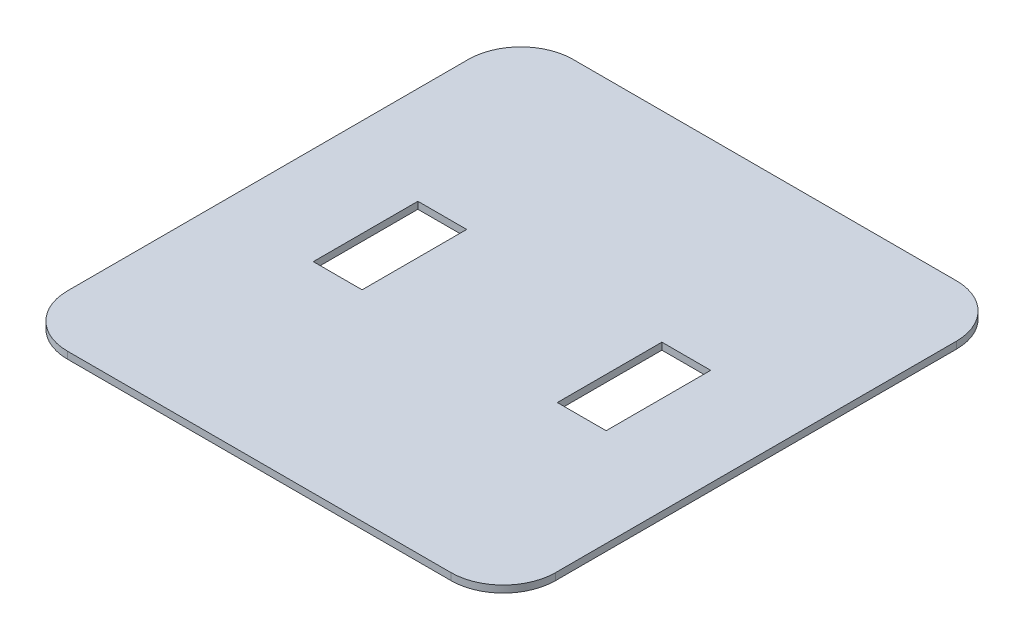
ISO-10303-21;
HEADER;
FILE_DESCRIPTION(('STEP AP214'),'2;1');
FILE_NAME('part.step','',(''),(''),'','','');
FILE_SCHEMA(('AUTOMOTIVE_DESIGN { 1 0 10303 214 1 1 1 1 }'));
ENDSEC;
DATA;
#1=APPLICATION_CONTEXT('core data for automotive mechanical design processes');
#2=APPLICATION_PROTOCOL_DEFINITION('international standard','automotive_design',2000,#1);
#3=PRODUCT_CONTEXT('',#1,'mechanical');
#4=PRODUCT('Part','Part','',(#3));
#5=PRODUCT_RELATED_PRODUCT_CATEGORY('part','',(#4));
#6=PRODUCT_DEFINITION_FORMATION('','',#4);
#7=PRODUCT_DEFINITION_CONTEXT('part definition',#1,'design');
#8=PRODUCT_DEFINITION('design','',#6,#7);
#9=PRODUCT_DEFINITION_SHAPE('','',#8);
#10=(LENGTH_UNIT() NAMED_UNIT(*) SI_UNIT(.MILLI.,.METRE.));
#11=(NAMED_UNIT(*) PLANE_ANGLE_UNIT() SI_UNIT($,.RADIAN.));
#12=(NAMED_UNIT(*) SI_UNIT($,.STERADIAN.) SOLID_ANGLE_UNIT());
#13=UNCERTAINTY_MEASURE_WITH_UNIT(LENGTH_MEASURE(1.E-05),#10,'distance_accuracy_value','');
#14=(GEOMETRIC_REPRESENTATION_CONTEXT(3) GLOBAL_UNCERTAINTY_ASSIGNED_CONTEXT((#13)) GLOBAL_UNIT_ASSIGNED_CONTEXT((#10,
#11,#12)) REPRESENTATION_CONTEXT('',''));
#15=CARTESIAN_POINT('',(0.,0.,0.));
#16=DIRECTION('',(0.,0.,1.));
#17=DIRECTION('',(1.,0.,0.));
#18=AXIS2_PLACEMENT_3D('',#15,#16,#17);
#19=CARTESIAN_POINT('',(-110.,4.,30.));
#20=DIRECTION('',(0.,1.,0.));
#21=DIRECTION('',(0.,0.,1.));
#22=AXIS2_PLACEMENT_3D('',#19,#20,#21);
#23=PLANE('',#22);
#24=DIRECTION('',(1.,0.,0.));
#25=VECTOR('',#24,1.);
#26=CARTESIAN_POINT('',(-84.,4.,175.));
#27=LINE('',#26,#25);
#28=CARTESIAN_POINT('',(-84.,4.,175.));
#29=VERTEX_POINT('',#28);
#30=CARTESIAN_POINT('',(-56.,4.,175.));
#31=VERTEX_POINT('',#30);
#32=EDGE_CURVE('E181',#29,#31,#27,.T.);
#33=ORIENTED_EDGE('',*,*,#32,.F.);
#34=DIRECTION('',(0.,0.,1.));
#35=VECTOR('',#34,1.);
#36=CARTESIAN_POINT('',(-84.,4.,175.));
#37=LINE('',#36,#35);
#38=CARTESIAN_POINT('',(-84.,4.,115.));
#39=VERTEX_POINT('',#38);
#40=EDGE_CURVE('E179',#39,#29,#37,.T.);
#41=ORIENTED_EDGE('',*,*,#40,.F.);
#42=DIRECTION('',(-1.,0.,0.));
#43=VECTOR('',#42,1.);
#44=CARTESIAN_POINT('',(-84.,4.,115.));
#45=LINE('',#44,#43);
#46=CARTESIAN_POINT('',(-56.,4.,115.));
#47=VERTEX_POINT('',#46);
#48=EDGE_CURVE('E187',#47,#39,#45,.T.);
#49=ORIENTED_EDGE('',*,*,#48,.F.);
#50=DIRECTION('',(0.,0.,-1.));
#51=VECTOR('',#50,1.);
#52=CARTESIAN_POINT('',(-56.,4.,175.));
#53=LINE('',#52,#51);
#54=EDGE_CURVE('E184',#31,#47,#53,.T.);
#55=ORIENTED_EDGE('',*,*,#54,.F.);
#56=EDGE_LOOP('',(#33,#41,#49,#55));
#57=FACE_BOUND('',#56,.T.);
#58=CARTESIAN_POINT('',(-110.,4.,30.));
#59=DIRECTION('',(0.,1.,0.));
#60=DIRECTION('',(0.,0.,1.));
#61=AXIS2_PLACEMENT_3D('',#58,#59,#60);
#62=CIRCLE('',#61,30.);
#63=CARTESIAN_POINT('',(-110.,4.,0.));
#64=VERTEX_POINT('',#63);
#65=CARTESIAN_POINT('',(-140.,4.,30.));
#66=VERTEX_POINT('',#65);
#67=EDGE_CURVE('E210',#64,#66,#62,.T.);
#68=ORIENTED_EDGE('',*,*,#67,.T.);
#69=DIRECTION('',(0.,0.,1.));
#70=VECTOR('',#69,1.);
#71=CARTESIAN_POINT('',(-140.,4.,30.));
#72=LINE('',#71,#70);
#73=CARTESIAN_POINT('',(-140.,4.,260.));
#74=VERTEX_POINT('',#73);
#75=EDGE_CURVE('E213',#66,#74,#72,.T.);
#76=ORIENTED_EDGE('',*,*,#75,.T.);
#77=CARTESIAN_POINT('',(-110.,4.,260.));
#78=DIRECTION('',(0.,1.,0.));
#79=DIRECTION('',(0.,0.,1.));
#80=AXIS2_PLACEMENT_3D('',#77,#78,#79);
#81=CIRCLE('',#80,30.);
#82=CARTESIAN_POINT('',(-110.,4.,290.));
#83=VERTEX_POINT('',#82);
#84=EDGE_CURVE('E216',#74,#83,#81,.T.);
#85=ORIENTED_EDGE('',*,*,#84,.T.);
#86=DIRECTION('',(1.,0.,0.));
#87=VECTOR('',#86,1.);
#88=CARTESIAN_POINT('',(-110.,4.,290.));
#89=LINE('',#88,#87);
#90=CARTESIAN_POINT('',(110.,4.,290.));
#91=VERTEX_POINT('',#90);
#92=EDGE_CURVE('E218',#83,#91,#89,.T.);
#93=ORIENTED_EDGE('',*,*,#92,.T.);
#94=CARTESIAN_POINT('',(110.,4.,260.));
#95=DIRECTION('',(0.,1.,0.));
#96=DIRECTION('',(0.,0.,-1.));
#97=AXIS2_PLACEMENT_3D('',#94,#95,#96);
#98=CIRCLE('',#97,30.);
#99=CARTESIAN_POINT('',(140.,4.,260.));
#100=VERTEX_POINT('',#99);
#101=EDGE_CURVE('E220',#91,#100,#98,.T.);
#102=ORIENTED_EDGE('',*,*,#101,.T.);
#103=DIRECTION('',(0.,0.,-1.));
#104=VECTOR('',#103,1.);
#105=CARTESIAN_POINT('',(140.,4.,30.));
#106=LINE('',#105,#104);
#107=CARTESIAN_POINT('',(140.,4.,30.));
#108=VERTEX_POINT('',#107);
#109=EDGE_CURVE('E222',#100,#108,#106,.T.);
#110=ORIENTED_EDGE('',*,*,#109,.T.);
#111=CARTESIAN_POINT('',(110.,4.,30.));
#112=DIRECTION('',(0.,1.,0.));
#113=DIRECTION('',(0.,0.,-1.));
#114=AXIS2_PLACEMENT_3D('',#111,#112,#113);
#115=CIRCLE('',#114,30.);
#116=CARTESIAN_POINT('',(110.,4.,0.));
#117=VERTEX_POINT('',#116);
#118=EDGE_CURVE('E224',#108,#117,#115,.T.);
#119=ORIENTED_EDGE('',*,*,#118,.T.);
#120=DIRECTION('',(-1.,0.,0.));
#121=VECTOR('',#120,1.);
#122=CARTESIAN_POINT('',(110.,4.,0.));
#123=LINE('',#122,#121);
#124=EDGE_CURVE('E226',#117,#64,#123,.T.);
#125=ORIENTED_EDGE('',*,*,#124,.T.);
#126=EDGE_LOOP('',(#68,#76,#85,#93,#102,#110,#119,#125));
#127=FACE_BOUND('',#126,.T.);
#128=DIRECTION('',(-1.,0.,0.));
#129=VECTOR('',#128,1.);
#130=CARTESIAN_POINT('',(84.,4.,115.));
#131=LINE('',#130,#129);
#132=CARTESIAN_POINT('',(84.,4.,115.));
#133=VERTEX_POINT('',#132);
#134=CARTESIAN_POINT('',(56.,4.,115.));
#135=VERTEX_POINT('',#134);
#136=EDGE_CURVE('E151',#133,#135,#131,.T.);
#137=ORIENTED_EDGE('',*,*,#136,.F.);
#138=DIRECTION('',(0.,0.,-1.));
#139=VECTOR('',#138,1.);
#140=CARTESIAN_POINT('',(84.,4.,175.));
#141=LINE('',#140,#139);
#142=CARTESIAN_POINT('',(84.,4.,175.));
#143=VERTEX_POINT('',#142);
#144=EDGE_CURVE('E143',#143,#133,#141,.T.);
#145=ORIENTED_EDGE('',*,*,#144,.F.);
#146=DIRECTION('',(1.,0.,0.));
#147=VECTOR('',#146,1.);
#148=CARTESIAN_POINT('',(84.,4.,175.));
#149=LINE('',#148,#147);
#150=CARTESIAN_POINT('',(56.,4.,175.));
#151=VERTEX_POINT('',#150);
#152=EDGE_CURVE('E165',#151,#143,#149,.T.);
#153=ORIENTED_EDGE('',*,*,#152,.F.);
#154=DIRECTION('',(0.,0.,1.));
#155=VECTOR('',#154,1.);
#156=CARTESIAN_POINT('',(56.,4.,175.));
#157=LINE('',#156,#155);
#158=EDGE_CURVE('E163',#135,#151,#157,.T.);
#159=ORIENTED_EDGE('',*,*,#158,.F.);
#160=EDGE_LOOP('',(#137,#145,#153,#159));
#161=FACE_BOUND('',#160,.T.);
#162=ADVANCED_FACE('F30',(#57,#127,#161),#23,.T.);
#163=CARTESIAN_POINT('',(-110.,0.,30.));
#164=DIRECTION('',(0.,1.,0.));
#165=DIRECTION('',(0.,0.,1.));
#166=AXIS2_PLACEMENT_3D('',#163,#164,#165);
#167=PLANE('',#166);
#168=DIRECTION('',(0.,0.,1.));
#169=VECTOR('',#168,1.);
#170=CARTESIAN_POINT('',(-84.,0.,175.));
#171=LINE('',#170,#169);
#172=CARTESIAN_POINT('',(-84.,0.,115.));
#173=VERTEX_POINT('',#172);
#174=CARTESIAN_POINT('',(-84.,0.,175.));
#175=VERTEX_POINT('',#174);
#176=EDGE_CURVE('E159',#173,#175,#171,.T.);
#177=ORIENTED_EDGE('',*,*,#176,.T.);
#178=DIRECTION('',(1.,0.,0.));
#179=VECTOR('',#178,1.);
#180=CARTESIAN_POINT('',(-84.,0.,175.));
#181=LINE('',#180,#179);
#182=CARTESIAN_POINT('',(-56.,0.,175.));
#183=VERTEX_POINT('',#182);
#184=EDGE_CURVE('E192',#175,#183,#181,.T.);
#185=ORIENTED_EDGE('',*,*,#184,.T.);
#186=DIRECTION('',(0.,0.,-1.));
#187=VECTOR('',#186,1.);
#188=CARTESIAN_POINT('',(-56.,0.,175.));
#189=LINE('',#188,#187);
#190=CARTESIAN_POINT('',(-56.,0.,115.));
#191=VERTEX_POINT('',#190);
#192=EDGE_CURVE('E195',#183,#191,#189,.T.);
#193=ORIENTED_EDGE('',*,*,#192,.T.);
#194=DIRECTION('',(-1.,0.,0.));
#195=VECTOR('',#194,1.);
#196=CARTESIAN_POINT('',(-84.,0.,115.));
#197=LINE('',#196,#195);
#198=EDGE_CURVE('E182',#191,#173,#197,.T.);
#199=ORIENTED_EDGE('',*,*,#198,.T.);
#200=EDGE_LOOP('',(#177,#185,#193,#199));
#201=FACE_BOUND('',#200,.T.);
#202=CARTESIAN_POINT('',(-110.,0.,30.));
#203=DIRECTION('',(0.,1.,0.));
#204=DIRECTION('',(0.,0.,1.));
#205=AXIS2_PLACEMENT_3D('',#202,#203,#204);
#206=CIRCLE('',#205,30.);
#207=CARTESIAN_POINT('',(-110.,0.,0.));
#208=VERTEX_POINT('',#207);
#209=CARTESIAN_POINT('',(-140.,0.,30.));
#210=VERTEX_POINT('',#209);
#211=EDGE_CURVE('E209',#208,#210,#206,.T.);
#212=ORIENTED_EDGE('',*,*,#211,.F.);
#213=DIRECTION('',(-1.,0.,0.));
#214=VECTOR('',#213,1.);
#215=CARTESIAN_POINT('',(110.,0.,0.));
#216=LINE('',#215,#214);
#217=CARTESIAN_POINT('',(110.,0.,0.));
#218=VERTEX_POINT('',#217);
#219=EDGE_CURVE('E214',#218,#208,#216,.T.);
#220=ORIENTED_EDGE('',*,*,#219,.F.);
#221=CARTESIAN_POINT('',(110.,0.,30.));
#222=DIRECTION('',(0.,1.,0.));
#223=DIRECTION('',(0.,0.,-1.));
#224=AXIS2_PLACEMENT_3D('',#221,#222,#223);
#225=CIRCLE('',#224,30.);
#226=CARTESIAN_POINT('',(140.,0.,30.));
#227=VERTEX_POINT('',#226);
#228=EDGE_CURVE('E241',#227,#218,#225,.T.);
#229=ORIENTED_EDGE('',*,*,#228,.F.);
#230=DIRECTION('',(0.,0.,-1.));
#231=VECTOR('',#230,1.);
#232=CARTESIAN_POINT('',(140.,0.,30.));
#233=LINE('',#232,#231);
#234=CARTESIAN_POINT('',(140.,0.,260.));
#235=VERTEX_POINT('',#234);
#236=EDGE_CURVE('E239',#235,#227,#233,.T.);
#237=ORIENTED_EDGE('',*,*,#236,.F.);
#238=CARTESIAN_POINT('',(110.,0.,260.));
#239=DIRECTION('',(0.,1.,0.));
#240=DIRECTION('',(0.,0.,-1.));
#241=AXIS2_PLACEMENT_3D('',#238,#239,#240);
#242=CIRCLE('',#241,30.);
#243=CARTESIAN_POINT('',(110.,0.,290.));
#244=VERTEX_POINT('',#243);
#245=EDGE_CURVE('E237',#244,#235,#242,.T.);
#246=ORIENTED_EDGE('',*,*,#245,.F.);
#247=DIRECTION('',(1.,0.,0.));
#248=VECTOR('',#247,1.);
#249=CARTESIAN_POINT('',(-110.,0.,290.));
#250=LINE('',#249,#248);
#251=CARTESIAN_POINT('',(-110.,0.,290.));
#252=VERTEX_POINT('',#251);
#253=EDGE_CURVE('E235',#252,#244,#250,.T.);
#254=ORIENTED_EDGE('',*,*,#253,.F.);
#255=CARTESIAN_POINT('',(-110.,0.,260.));
#256=DIRECTION('',(0.,1.,0.));
#257=DIRECTION('',(0.,0.,1.));
#258=AXIS2_PLACEMENT_3D('',#255,#256,#257);
#259=CIRCLE('',#258,30.);
#260=CARTESIAN_POINT('',(-140.,0.,260.));
#261=VERTEX_POINT('',#260);
#262=EDGE_CURVE('E233',#261,#252,#259,.T.);
#263=ORIENTED_EDGE('',*,*,#262,.F.);
#264=DIRECTION('',(0.,0.,1.));
#265=VECTOR('',#264,1.);
#266=CARTESIAN_POINT('',(-140.,0.,30.));
#267=LINE('',#266,#265);
#268=EDGE_CURVE('E231',#210,#261,#267,.T.);
#269=ORIENTED_EDGE('',*,*,#268,.F.);
#270=EDGE_LOOP('',(#212,#220,#229,#237,#246,#254,#263,#269));
#271=FACE_BOUND('',#270,.T.);
#272=DIRECTION('',(0.,0.,-1.));
#273=VECTOR('',#272,1.);
#274=CARTESIAN_POINT('',(84.,0.,175.));
#275=LINE('',#274,#273);
#276=CARTESIAN_POINT('',(84.,0.,175.));
#277=VERTEX_POINT('',#276);
#278=CARTESIAN_POINT('',(84.,0.,115.));
#279=VERTEX_POINT('',#278);
#280=EDGE_CURVE('E53',#277,#279,#275,.T.);
#281=ORIENTED_EDGE('',*,*,#280,.T.);
#282=DIRECTION('',(-1.,0.,0.));
#283=VECTOR('',#282,1.);
#284=CARTESIAN_POINT('',(84.,0.,115.));
#285=LINE('',#284,#283);
#286=CARTESIAN_POINT('',(56.,0.,115.));
#287=VERTEX_POINT('',#286);
#288=EDGE_CURVE('E158',#279,#287,#285,.T.);
#289=ORIENTED_EDGE('',*,*,#288,.T.);
#290=DIRECTION('',(0.,0.,1.));
#291=VECTOR('',#290,1.);
#292=CARTESIAN_POINT('',(56.,0.,175.));
#293=LINE('',#292,#291);
#294=CARTESIAN_POINT('',(56.,0.,175.));
#295=VERTEX_POINT('',#294);
#296=EDGE_CURVE('E171',#287,#295,#293,.T.);
#297=ORIENTED_EDGE('',*,*,#296,.T.);
#298=DIRECTION('',(1.,0.,0.));
#299=VECTOR('',#298,1.);
#300=CARTESIAN_POINT('',(84.,0.,175.));
#301=LINE('',#300,#299);
#302=EDGE_CURVE('E152',#295,#277,#301,.T.);
#303=ORIENTED_EDGE('',*,*,#302,.T.);
#304=EDGE_LOOP('',(#281,#289,#297,#303));
#305=FACE_BOUND('',#304,.T.);
#306=ADVANCED_FACE('F271',(#201,#271,#305),#167,.F.);
#307=CARTESIAN_POINT('',(-110.,4.,30.));
#308=DIRECTION('',(0.,-1.,0.));
#309=DIRECTION('',(0.,0.,-1.));
#310=AXIS2_PLACEMENT_3D('',#307,#308,#309);
#311=CYLINDRICAL_SURFACE('',#310,30.);
#312=ORIENTED_EDGE('',*,*,#211,.T.);
#313=DIRECTION('',(0.,-1.,0.));
#314=VECTOR('',#313,1.);
#315=CARTESIAN_POINT('',(-140.,4.,30.));
#316=LINE('',#315,#314);
#317=EDGE_CURVE('E11',#66,#210,#316,.T.);
#318=ORIENTED_EDGE('',*,*,#317,.F.);
#319=ORIENTED_EDGE('',*,*,#67,.F.);
#320=DIRECTION('',(0.,-1.,0.));
#321=VECTOR('',#320,1.);
#322=CARTESIAN_POINT('',(-110.,4.,0.));
#323=LINE('',#322,#321);
#324=EDGE_CURVE('E228',#64,#208,#323,.T.);
#325=ORIENTED_EDGE('',*,*,#324,.T.);
#326=EDGE_LOOP('',(#312,#318,#319,#325));
#327=FACE_BOUND('',#326,.T.);
#328=ADVANCED_FACE('F32',(#327),#311,.T.);
#329=CARTESIAN_POINT('',(-140.,4.,30.));
#330=DIRECTION('',(1.,0.,0.));
#331=DIRECTION('',(0.,0.,-1.));
#332=AXIS2_PLACEMENT_3D('',#329,#330,#331);
#333=PLANE('',#332);
#334=ORIENTED_EDGE('',*,*,#268,.T.);
#335=DIRECTION('',(0.,-1.,0.));
#336=VECTOR('',#335,1.);
#337=CARTESIAN_POINT('',(-140.,4.,260.));
#338=LINE('',#337,#336);
#339=EDGE_CURVE('E38',#74,#261,#338,.T.);
#340=ORIENTED_EDGE('',*,*,#339,.F.);
#341=ORIENTED_EDGE('',*,*,#75,.F.);
#342=ORIENTED_EDGE('',*,*,#317,.T.);
#343=EDGE_LOOP('',(#334,#340,#341,#342));
#344=FACE_BOUND('',#343,.T.);
#345=ADVANCED_FACE('F288',(#344),#333,.F.);
#346=CARTESIAN_POINT('',(-110.,4.,260.));
#347=DIRECTION('',(0.,-1.,0.));
#348=DIRECTION('',(0.,0.,-1.));
#349=AXIS2_PLACEMENT_3D('',#346,#347,#348);
#350=CYLINDRICAL_SURFACE('',#349,30.);
#351=ORIENTED_EDGE('',*,*,#262,.T.);
#352=DIRECTION('',(0.,-1.,0.));
#353=VECTOR('',#352,1.);
#354=CARTESIAN_POINT('',(-110.,4.,290.));
#355=LINE('',#354,#353);
#356=EDGE_CURVE('E258',#83,#252,#355,.T.);
#357=ORIENTED_EDGE('',*,*,#356,.F.);
#358=ORIENTED_EDGE('',*,*,#84,.F.);
#359=ORIENTED_EDGE('',*,*,#339,.T.);
#360=EDGE_LOOP('',(#351,#357,#358,#359));
#361=FACE_BOUND('',#360,.T.);
#362=ADVANCED_FACE('F265',(#361),#350,.T.);
#363=CARTESIAN_POINT('',(-110.,4.,290.));
#364=DIRECTION('',(0.,0.,-1.));
#365=DIRECTION('',(-1.,0.,0.));
#366=AXIS2_PLACEMENT_3D('',#363,#364,#365);
#367=PLANE('',#366);
#368=ORIENTED_EDGE('',*,*,#253,.T.);
#369=DIRECTION('',(0.,-1.,0.));
#370=VECTOR('',#369,1.);
#371=CARTESIAN_POINT('',(110.,4.,290.));
#372=LINE('',#371,#370);
#373=EDGE_CURVE('E255',#91,#244,#372,.T.);
#374=ORIENTED_EDGE('',*,*,#373,.F.);
#375=ORIENTED_EDGE('',*,*,#92,.F.);
#376=ORIENTED_EDGE('',*,*,#356,.T.);
#377=EDGE_LOOP('',(#368,#374,#375,#376));
#378=FACE_BOUND('',#377,.T.);
#379=ADVANCED_FACE('F277',(#378),#367,.F.);
#380=CARTESIAN_POINT('',(110.,4.,260.));
#381=DIRECTION('',(0.,-1.,0.));
#382=DIRECTION('',(0.,0.,-1.));
#383=AXIS2_PLACEMENT_3D('',#380,#381,#382);
#384=CYLINDRICAL_SURFACE('',#383,30.);
#385=ORIENTED_EDGE('',*,*,#245,.T.);
#386=DIRECTION('',(0.,-1.,0.));
#387=VECTOR('',#386,1.);
#388=CARTESIAN_POINT('',(140.,4.,260.));
#389=LINE('',#388,#387);
#390=EDGE_CURVE('E252',#100,#235,#389,.T.);
#391=ORIENTED_EDGE('',*,*,#390,.F.);
#392=ORIENTED_EDGE('',*,*,#101,.F.);
#393=ORIENTED_EDGE('',*,*,#373,.T.);
#394=EDGE_LOOP('',(#385,#391,#392,#393));
#395=FACE_BOUND('',#394,.T.);
#396=ADVANCED_FACE('F281',(#395),#384,.T.);
#397=CARTESIAN_POINT('',(140.,4.,30.));
#398=DIRECTION('',(-1.,0.,0.));
#399=DIRECTION('',(0.,0.,1.));
#400=AXIS2_PLACEMENT_3D('',#397,#398,#399);
#401=PLANE('',#400);
#402=ORIENTED_EDGE('',*,*,#236,.T.);
#403=DIRECTION('',(0.,-1.,0.));
#404=VECTOR('',#403,1.);
#405=CARTESIAN_POINT('',(140.,4.,30.));
#406=LINE('',#405,#404);
#407=EDGE_CURVE('E249',#108,#227,#406,.T.);
#408=ORIENTED_EDGE('',*,*,#407,.F.);
#409=ORIENTED_EDGE('',*,*,#109,.F.);
#410=ORIENTED_EDGE('',*,*,#390,.T.);
#411=EDGE_LOOP('',(#402,#408,#409,#410));
#412=FACE_BOUND('',#411,.T.);
#413=ADVANCED_FACE('F301',(#412),#401,.F.);
#414=CARTESIAN_POINT('',(110.,4.,30.));
#415=DIRECTION('',(0.,-1.,0.));
#416=DIRECTION('',(0.,0.,-1.));
#417=AXIS2_PLACEMENT_3D('',#414,#415,#416);
#418=CYLINDRICAL_SURFACE('',#417,30.);
#419=ORIENTED_EDGE('',*,*,#228,.T.);
#420=DIRECTION('',(0.,-1.,0.));
#421=VECTOR('',#420,1.);
#422=CARTESIAN_POINT('',(110.,4.,0.));
#423=LINE('',#422,#421);
#424=EDGE_CURVE('E246',#117,#218,#423,.T.);
#425=ORIENTED_EDGE('',*,*,#424,.F.);
#426=ORIENTED_EDGE('',*,*,#118,.F.);
#427=ORIENTED_EDGE('',*,*,#407,.T.);
#428=EDGE_LOOP('',(#419,#425,#426,#427));
#429=FACE_BOUND('',#428,.T.);
#430=ADVANCED_FACE('F299',(#429),#418,.T.);
#431=CARTESIAN_POINT('',(110.,4.,0.));
#432=DIRECTION('',(0.,0.,1.));
#433=DIRECTION('',(1.,0.,0.));
#434=AXIS2_PLACEMENT_3D('',#431,#432,#433);
#435=PLANE('',#434);
#436=ORIENTED_EDGE('',*,*,#219,.T.);
#437=ORIENTED_EDGE('',*,*,#324,.F.);
#438=ORIENTED_EDGE('',*,*,#124,.F.);
#439=ORIENTED_EDGE('',*,*,#424,.T.);
#440=EDGE_LOOP('',(#436,#437,#438,#439));
#441=FACE_BOUND('',#440,.T.);
#442=ADVANCED_FACE('F294',(#441),#435,.F.);
#443=CARTESIAN_POINT('',(-84.,4.,175.));
#444=DIRECTION('',(1.,0.,0.));
#445=DIRECTION('',(0.,0.,-1.));
#446=AXIS2_PLACEMENT_3D('',#443,#444,#445);
#447=PLANE('',#446);
#448=ORIENTED_EDGE('',*,*,#176,.F.);
#449=DIRECTION('',(0.,-1.,0.));
#450=VECTOR('',#449,1.);
#451=CARTESIAN_POINT('',(-84.,4.,115.));
#452=LINE('',#451,#450);
#453=EDGE_CURVE('E189',#39,#173,#452,.T.);
#454=ORIENTED_EDGE('',*,*,#453,.F.);
#455=ORIENTED_EDGE('',*,*,#40,.T.);
#456=DIRECTION('',(0.,-1.,0.));
#457=VECTOR('',#456,1.);
#458=CARTESIAN_POINT('',(-84.,4.,175.));
#459=LINE('',#458,#457);
#460=EDGE_CURVE('E206',#29,#175,#459,.T.);
#461=ORIENTED_EDGE('',*,*,#460,.T.);
#462=EDGE_LOOP('',(#448,#454,#455,#461));
#463=FACE_BOUND('',#462,.T.);
#464=ADVANCED_FACE('F320',(#463),#447,.T.);
#465=CARTESIAN_POINT('',(-84.,4.,175.));
#466=DIRECTION('',(0.,0.,-1.));
#467=DIRECTION('',(-1.,0.,0.));
#468=AXIS2_PLACEMENT_3D('',#465,#466,#467);
#469=PLANE('',#468);
#470=ORIENTED_EDGE('',*,*,#184,.F.);
#471=ORIENTED_EDGE('',*,*,#460,.F.);
#472=ORIENTED_EDGE('',*,*,#32,.T.);
#473=DIRECTION('',(0.,-1.,0.));
#474=VECTOR('',#473,1.);
#475=CARTESIAN_POINT('',(-56.,4.,175.));
#476=LINE('',#475,#474);
#477=EDGE_CURVE('E204',#31,#183,#476,.T.);
#478=ORIENTED_EDGE('',*,*,#477,.T.);
#479=EDGE_LOOP('',(#470,#471,#472,#478));
#480=FACE_BOUND('',#479,.T.);
#481=ADVANCED_FACE('F327',(#480),#469,.T.);
#482=CARTESIAN_POINT('',(-56.,4.,175.));
#483=DIRECTION('',(-1.,0.,0.));
#484=DIRECTION('',(0.,0.,1.));
#485=AXIS2_PLACEMENT_3D('',#482,#483,#484);
#486=PLANE('',#485);
#487=ORIENTED_EDGE('',*,*,#192,.F.);
#488=ORIENTED_EDGE('',*,*,#477,.F.);
#489=ORIENTED_EDGE('',*,*,#54,.T.);
#490=DIRECTION('',(0.,-1.,0.));
#491=VECTOR('',#490,1.);
#492=CARTESIAN_POINT('',(-56.,4.,115.));
#493=LINE('',#492,#491);
#494=EDGE_CURVE('E202',#47,#191,#493,.T.);
#495=ORIENTED_EDGE('',*,*,#494,.T.);
#496=EDGE_LOOP('',(#487,#488,#489,#495));
#497=FACE_BOUND('',#496,.T.);
#498=ADVANCED_FACE('F332',(#497),#486,.T.);
#499=CARTESIAN_POINT('',(-84.,4.,115.));
#500=DIRECTION('',(0.,0.,1.));
#501=DIRECTION('',(1.,0.,0.));
#502=AXIS2_PLACEMENT_3D('',#499,#500,#501);
#503=PLANE('',#502);
#504=ORIENTED_EDGE('',*,*,#198,.F.);
#505=ORIENTED_EDGE('',*,*,#494,.F.);
#506=ORIENTED_EDGE('',*,*,#48,.T.);
#507=ORIENTED_EDGE('',*,*,#453,.T.);
#508=EDGE_LOOP('',(#504,#505,#506,#507));
#509=FACE_BOUND('',#508,.T.);
#510=ADVANCED_FACE('F339',(#509),#503,.T.);
#511=CARTESIAN_POINT('',(84.,4.,175.));
#512=DIRECTION('',(-1.,0.,0.));
#513=DIRECTION('',(0.,0.,1.));
#514=AXIS2_PLACEMENT_3D('',#511,#512,#513);
#515=PLANE('',#514);
#516=ORIENTED_EDGE('',*,*,#280,.F.);
#517=DIRECTION('',(0.,-1.,0.));
#518=VECTOR('',#517,1.);
#519=CARTESIAN_POINT('',(84.,4.,175.));
#520=LINE('',#519,#518);
#521=EDGE_CURVE('E147',#143,#277,#520,.T.);
#522=ORIENTED_EDGE('',*,*,#521,.F.);
#523=ORIENTED_EDGE('',*,*,#144,.T.);
#524=DIRECTION('',(0.,-1.,0.));
#525=VECTOR('',#524,1.);
#526=CARTESIAN_POINT('',(84.,4.,115.));
#527=LINE('',#526,#525);
#528=EDGE_CURVE('E146',#133,#279,#527,.T.);
#529=ORIENTED_EDGE('',*,*,#528,.T.);
#530=EDGE_LOOP('',(#516,#522,#523,#529));
#531=FACE_BOUND('',#530,.T.);
#532=ADVANCED_FACE('F145',(#531),#515,.T.);
#533=CARTESIAN_POINT('',(84.,4.,115.));
#534=DIRECTION('',(0.,0.,1.));
#535=DIRECTION('',(1.,0.,0.));
#536=AXIS2_PLACEMENT_3D('',#533,#534,#535);
#537=PLANE('',#536);
#538=ORIENTED_EDGE('',*,*,#288,.F.);
#539=ORIENTED_EDGE('',*,*,#528,.F.);
#540=ORIENTED_EDGE('',*,*,#136,.T.);
#541=DIRECTION('',(0.,-1.,0.));
#542=VECTOR('',#541,1.);
#543=CARTESIAN_POINT('',(56.,4.,115.));
#544=LINE('',#543,#542);
#545=EDGE_CURVE('E160',#135,#287,#544,.T.);
#546=ORIENTED_EDGE('',*,*,#545,.T.);
#547=EDGE_LOOP('',(#538,#539,#540,#546));
#548=FACE_BOUND('',#547,.T.);
#549=ADVANCED_FACE('F155',(#548),#537,.T.);
#550=CARTESIAN_POINT('',(56.,4.,175.));
#551=DIRECTION('',(1.,0.,0.));
#552=DIRECTION('',(0.,0.,-1.));
#553=AXIS2_PLACEMENT_3D('',#550,#551,#552);
#554=PLANE('',#553);
#555=ORIENTED_EDGE('',*,*,#296,.F.);
#556=ORIENTED_EDGE('',*,*,#545,.F.);
#557=ORIENTED_EDGE('',*,*,#158,.T.);
#558=DIRECTION('',(0.,-1.,0.));
#559=VECTOR('',#558,1.);
#560=CARTESIAN_POINT('',(56.,4.,175.));
#561=LINE('',#560,#559);
#562=EDGE_CURVE('E45',#151,#295,#561,.T.);
#563=ORIENTED_EDGE('',*,*,#562,.T.);
#564=EDGE_LOOP('',(#555,#556,#557,#563));
#565=FACE_BOUND('',#564,.T.);
#566=ADVANCED_FACE('F356',(#565),#554,.T.);
#567=CARTESIAN_POINT('',(84.,4.,175.));
#568=DIRECTION('',(0.,0.,-1.));
#569=DIRECTION('',(-1.,0.,0.));
#570=AXIS2_PLACEMENT_3D('',#567,#568,#569);
#571=PLANE('',#570);
#572=ORIENTED_EDGE('',*,*,#302,.F.);
#573=ORIENTED_EDGE('',*,*,#562,.F.);
#574=ORIENTED_EDGE('',*,*,#152,.T.);
#575=ORIENTED_EDGE('',*,*,#521,.T.);
#576=EDGE_LOOP('',(#572,#573,#574,#575));
#577=FACE_BOUND('',#576,.T.);
#578=ADVANCED_FACE('F359',(#577),#571,.T.);
#579=CLOSED_SHELL('',(#162,#306,#328,#345,#362,#379,#396,#413,#430,#442,#464,#481,#498,#510,
#532,#549,#566,#578));
#580=MANIFOLD_SOLID_BREP('B2',#579);
#581=ADVANCED_BREP_SHAPE_REPRESENTATION('',(#18,#580),#14);
#582=SHAPE_DEFINITION_REPRESENTATION(#9,#581);
ENDSEC;
END-ISO-10303-21;
